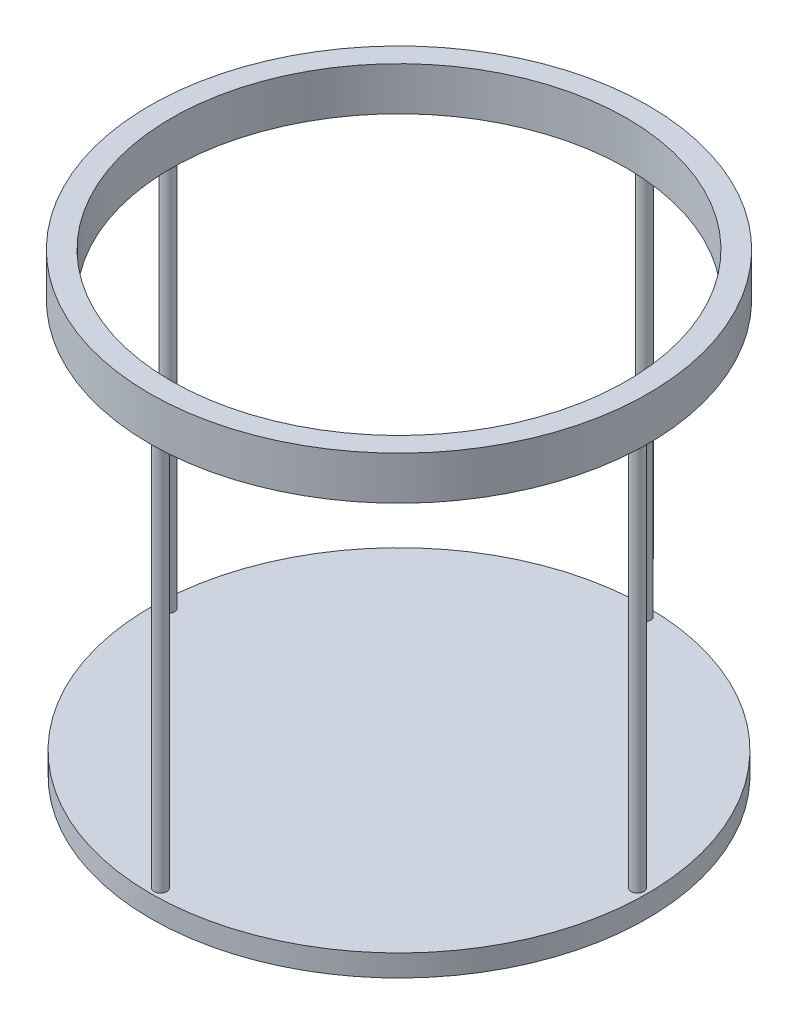
ISO-10303-21;
HEADER;
FILE_DESCRIPTION(('STEP AP214'),'2;1');
FILE_NAME('part.step','',(''),(''),'','','');
FILE_SCHEMA(('AUTOMOTIVE_DESIGN { 1 0 10303 214 1 1 1 1 }'));
ENDSEC;
DATA;
#1=APPLICATION_CONTEXT('core data for automotive mechanical design processes');
#2=APPLICATION_PROTOCOL_DEFINITION('international standard','automotive_design',2000,#1);
#3=PRODUCT_CONTEXT('',#1,'mechanical');
#4=PRODUCT('Part','Part','',(#3));
#5=PRODUCT_RELATED_PRODUCT_CATEGORY('part','',(#4));
#6=PRODUCT_DEFINITION_FORMATION('','',#4);
#7=PRODUCT_DEFINITION_CONTEXT('part definition',#1,'design');
#8=PRODUCT_DEFINITION('design','',#6,#7);
#9=PRODUCT_DEFINITION_SHAPE('','',#8);
#10=(LENGTH_UNIT() NAMED_UNIT(*) SI_UNIT(.MILLI.,.METRE.));
#11=(NAMED_UNIT(*) PLANE_ANGLE_UNIT() SI_UNIT($,.RADIAN.));
#12=(NAMED_UNIT(*) SI_UNIT($,.STERADIAN.) SOLID_ANGLE_UNIT());
#13=UNCERTAINTY_MEASURE_WITH_UNIT(LENGTH_MEASURE(1.E-05),#10,'distance_accuracy_value','');
#14=(GEOMETRIC_REPRESENTATION_CONTEXT(3) GLOBAL_UNCERTAINTY_ASSIGNED_CONTEXT((#13)) GLOBAL_UNIT_ASSIGNED_CONTEXT((#10,
#11,#12)) REPRESENTATION_CONTEXT('',''));
#15=CARTESIAN_POINT('',(0.,0.,0.));
#16=DIRECTION('',(0.,0.,1.));
#17=DIRECTION('',(1.,0.,0.));
#18=AXIS2_PLACEMENT_3D('',#15,#16,#17);
#19=CARTESIAN_POINT('',(0.,10.,0.));
#20=DIRECTION('',(0.,1.,0.));
#21=DIRECTION('',(0.,0.,1.));
#22=AXIS2_PLACEMENT_3D('',#19,#20,#21);
#23=PLANE('',#22);
#24=CARTESIAN_POINT('',(0.,10.,0.));
#25=DIRECTION('',(0.,1.,0.));
#26=DIRECTION('',(0.,0.,1.));
#27=AXIS2_PLACEMENT_3D('',#24,#25,#26);
#28=CIRCLE('',#27,57.5);
#29=CARTESIAN_POINT('',(0.,10.,57.5));
#30=VERTEX_POINT('',#29);
#31=EDGE_CURVE('E51',#30,#30,#28,.T.);
#32=ORIENTED_EDGE('',*,*,#31,.T.);
#33=EDGE_LOOP('',(#32));
#34=FACE_BOUND('',#33,.T.);
#35=CARTESIAN_POINT('',(0.,10.,0.));
#36=DIRECTION('',(0.,1.,0.));
#37=DIRECTION('',(0.,0.,1.));
#38=AXIS2_PLACEMENT_3D('',#35,#36,#37);
#39=CIRCLE('',#38,52.5);
#40=CARTESIAN_POINT('',(0.,10.,52.5));
#41=VERTEX_POINT('',#40);
#42=EDGE_CURVE('E55',#41,#41,#39,.T.);
#43=ORIENTED_EDGE('',*,*,#42,.F.);
#44=EDGE_LOOP('',(#43));
#45=FACE_BOUND('',#44,.T.);
#46=ADVANCED_FACE('F31',(#34,#45),#23,.T.);
#47=CARTESIAN_POINT('',(0.,0.,0.));
#48=DIRECTION('',(0.,1.,0.));
#49=DIRECTION('',(0.,0.,1.));
#50=AXIS2_PLACEMENT_3D('',#47,#48,#49);
#51=PLANE('',#50);
#52=CARTESIAN_POINT('',(-55.,0.,-1.76031313179692));
#53=DIRECTION('',(0.,1.,0.));
#54=DIRECTION('',(0.,0.,1.));
#55=AXIS2_PLACEMENT_3D('',#52,#53,#54);
#56=CIRCLE('',#55,1.45);
#57=CARTESIAN_POINT('',(-55.,0.,-0.310313131796919));
#58=VERTEX_POINT('',#57);
#59=EDGE_CURVE('E10',#58,#58,#56,.F.);
#60=ORIENTED_EDGE('',*,*,#59,.F.);
#61=EDGE_LOOP('',(#60));
#62=FACE_BOUND('',#61,.T.);
#63=CARTESIAN_POINT('',(55.,0.,0.));
#64=DIRECTION('',(0.,1.,0.));
#65=DIRECTION('',(0.,0.,1.));
#66=AXIS2_PLACEMENT_3D('',#63,#64,#65);
#67=CIRCLE('',#66,1.45);
#68=CARTESIAN_POINT('',(55.,0.,1.45));
#69=VERTEX_POINT('',#68);
#70=EDGE_CURVE('E38',#69,#69,#67,.F.);
#71=ORIENTED_EDGE('',*,*,#70,.F.);
#72=EDGE_LOOP('',(#71));
#73=FACE_BOUND('',#72,.T.);
#74=CARTESIAN_POINT('',(1.57822376486978,0.,-55.));
#75=DIRECTION('',(0.,1.,0.));
#76=DIRECTION('',(0.,0.,1.));
#77=AXIS2_PLACEMENT_3D('',#74,#75,#76);
#78=CIRCLE('',#77,1.45);
#79=CARTESIAN_POINT('',(1.57822376486978,0.,-53.55));
#80=VERTEX_POINT('',#79);
#81=EDGE_CURVE('E42',#80,#80,#78,.F.);
#82=ORIENTED_EDGE('',*,*,#81,.F.);
#83=EDGE_LOOP('',(#82));
#84=FACE_BOUND('',#83,.T.);
#85=CARTESIAN_POINT('',(0.,0.,55.));
#86=DIRECTION('',(0.,1.,0.));
#87=DIRECTION('',(0.,0.,1.));
#88=AXIS2_PLACEMENT_3D('',#85,#86,#87);
#89=CIRCLE('',#88,1.45);
#90=CARTESIAN_POINT('',(0.,0.,56.45));
#91=VERTEX_POINT('',#90);
#92=EDGE_CURVE('E46',#91,#91,#89,.F.);
#93=ORIENTED_EDGE('',*,*,#92,.F.);
#94=EDGE_LOOP('',(#93));
#95=FACE_BOUND('',#94,.T.);
#96=CARTESIAN_POINT('',(0.,0.,0.));
#97=DIRECTION('',(0.,1.,0.));
#98=DIRECTION('',(0.,0.,1.));
#99=AXIS2_PLACEMENT_3D('',#96,#97,#98);
#100=CIRCLE('',#99,57.5);
#101=CARTESIAN_POINT('',(0.,0.,57.5));
#102=VERTEX_POINT('',#101);
#103=EDGE_CURVE('E52',#102,#102,#100,.T.);
#104=ORIENTED_EDGE('',*,*,#103,.F.);
#105=EDGE_LOOP('',(#104));
#106=FACE_BOUND('',#105,.T.);
#107=CARTESIAN_POINT('',(0.,0.,0.));
#108=DIRECTION('',(0.,1.,0.));
#109=DIRECTION('',(0.,0.,1.));
#110=AXIS2_PLACEMENT_3D('',#107,#108,#109);
#111=CIRCLE('',#110,52.5);
#112=CARTESIAN_POINT('',(0.,0.,52.5));
#113=VERTEX_POINT('',#112);
#114=EDGE_CURVE('E58',#113,#113,#111,.T.);
#115=ORIENTED_EDGE('',*,*,#114,.T.);
#116=EDGE_LOOP('',(#115));
#117=FACE_BOUND('',#116,.T.);
#118=ADVANCED_FACE('F101',(#62,#73,#84,#95,#106,#117),#51,.F.);
#119=CARTESIAN_POINT('',(0.,10.,0.));
#120=DIRECTION('',(0.,-1.,0.));
#121=DIRECTION('',(0.,0.,-1.));
#122=AXIS2_PLACEMENT_3D('',#119,#120,#121);
#123=CYLINDRICAL_SURFACE('',#122,57.5);
#124=ORIENTED_EDGE('',*,*,#31,.F.);
#125=EDGE_LOOP('',(#124));
#126=FACE_BOUND('',#125,.T.);
#127=ORIENTED_EDGE('',*,*,#103,.T.);
#128=EDGE_LOOP('',(#127));
#129=FACE_BOUND('',#128,.T.);
#130=ADVANCED_FACE('F33',(#126,#129),#123,.T.);
#131=CARTESIAN_POINT('',(0.,10.,0.));
#132=DIRECTION('',(0.,-1.,0.));
#133=DIRECTION('',(0.,0.,-1.));
#134=AXIS2_PLACEMENT_3D('',#131,#132,#133);
#135=CYLINDRICAL_SURFACE('',#134,52.5);
#136=ORIENTED_EDGE('',*,*,#42,.T.);
#137=EDGE_LOOP('',(#136));
#138=FACE_BOUND('',#137,.T.);
#139=ORIENTED_EDGE('',*,*,#114,.F.);
#140=EDGE_LOOP('',(#139));
#141=FACE_BOUND('',#140,.T.);
#142=ADVANCED_FACE('F110',(#138,#141),#135,.F.);
#143=CARTESIAN_POINT('',(0.,-90.,55.));
#144=DIRECTION('',(0.,1.,0.));
#145=DIRECTION('',(0.,0.,1.));
#146=AXIS2_PLACEMENT_3D('',#143,#144,#145);
#147=CYLINDRICAL_SURFACE('',#146,1.45);
#148=CARTESIAN_POINT('',(0.,-90.,55.));
#149=DIRECTION('',(0.,-1.,0.));
#150=DIRECTION('',(0.,0.,-1.));
#151=AXIS2_PLACEMENT_3D('',#148,#149,#150);
#152=CIRCLE('',#151,1.45);
#153=CARTESIAN_POINT('',(0.,-90.,53.55));
#154=VERTEX_POINT('',#153);
#155=EDGE_CURVE('E61',#154,#154,#152,.T.);
#156=ORIENTED_EDGE('',*,*,#155,.F.);
#157=EDGE_LOOP('',(#156));
#158=FACE_BOUND('',#157,.T.);
#159=ORIENTED_EDGE('',*,*,#92,.T.);
#160=EDGE_LOOP('',(#159));
#161=FACE_BOUND('',#160,.T.);
#162=ADVANCED_FACE('F113',(#158,#161),#147,.T.);
#163=CARTESIAN_POINT('',(1.57822376486978,-90.,-55.));
#164=DIRECTION('',(0.,1.,0.));
#165=DIRECTION('',(0.,0.,1.));
#166=AXIS2_PLACEMENT_3D('',#163,#164,#165);
#167=CYLINDRICAL_SURFACE('',#166,1.45);
#168=CARTESIAN_POINT('',(1.57822376486978,-90.,-55.));
#169=DIRECTION('',(0.,-1.,0.));
#170=DIRECTION('',(0.,0.,-1.));
#171=AXIS2_PLACEMENT_3D('',#168,#169,#170);
#172=CIRCLE('',#171,1.45);
#173=CARTESIAN_POINT('',(1.57822376486978,-90.,-56.45));
#174=VERTEX_POINT('',#173);
#175=EDGE_CURVE('E66',#174,#174,#172,.T.);
#176=ORIENTED_EDGE('',*,*,#175,.F.);
#177=EDGE_LOOP('',(#176));
#178=FACE_BOUND('',#177,.T.);
#179=ORIENTED_EDGE('',*,*,#81,.T.);
#180=EDGE_LOOP('',(#179));
#181=FACE_BOUND('',#180,.T.);
#182=ADVANCED_FACE('F117',(#178,#181),#167,.T.);
#183=CARTESIAN_POINT('',(55.,-90.,0.));
#184=DIRECTION('',(0.,1.,0.));
#185=DIRECTION('',(0.,0.,1.));
#186=AXIS2_PLACEMENT_3D('',#183,#184,#185);
#187=CYLINDRICAL_SURFACE('',#186,1.45);
#188=CARTESIAN_POINT('',(55.,-90.,0.));
#189=DIRECTION('',(0.,-1.,0.));
#190=DIRECTION('',(0.,0.,-1.));
#191=AXIS2_PLACEMENT_3D('',#188,#189,#190);
#192=CIRCLE('',#191,1.45);
#193=CARTESIAN_POINT('',(55.,-90.,-1.45));
#194=VERTEX_POINT('',#193);
#195=EDGE_CURVE('E69',#194,#194,#192,.T.);
#196=ORIENTED_EDGE('',*,*,#195,.F.);
#197=EDGE_LOOP('',(#196));
#198=FACE_BOUND('',#197,.T.);
#199=ORIENTED_EDGE('',*,*,#70,.T.);
#200=EDGE_LOOP('',(#199));
#201=FACE_BOUND('',#200,.T.);
#202=ADVANCED_FACE('F121',(#198,#201),#187,.T.);
#203=CARTESIAN_POINT('',(-55.,-90.,-1.76031313179692));
#204=DIRECTION('',(0.,1.,0.));
#205=DIRECTION('',(0.,0.,1.));
#206=AXIS2_PLACEMENT_3D('',#203,#204,#205);
#207=CYLINDRICAL_SURFACE('',#206,1.45);
#208=CARTESIAN_POINT('',(-55.,-90.,-1.76031313179692));
#209=DIRECTION('',(0.,-1.,0.));
#210=DIRECTION('',(0.,0.,-1.));
#211=AXIS2_PLACEMENT_3D('',#208,#209,#210);
#212=CIRCLE('',#211,1.45);
#213=CARTESIAN_POINT('',(-55.,-90.,-3.21031313179692));
#214=VERTEX_POINT('',#213);
#215=EDGE_CURVE('E72',#214,#214,#212,.T.);
#216=ORIENTED_EDGE('',*,*,#215,.F.);
#217=EDGE_LOOP('',(#216));
#218=FACE_BOUND('',#217,.T.);
#219=ORIENTED_EDGE('',*,*,#59,.T.);
#220=EDGE_LOOP('',(#219));
#221=FACE_BOUND('',#220,.T.);
#222=ADVANCED_FACE('F87',(#218,#221),#207,.T.);
#223=CARTESIAN_POINT('',(0.,-95.,0.));
#224=DIRECTION('',(0.,1.,0.));
#225=DIRECTION('',(0.,0.,1.));
#226=AXIS2_PLACEMENT_3D('',#223,#224,#225);
#227=CYLINDRICAL_SURFACE('',#226,57.2276641342973);
#228=CARTESIAN_POINT('',(0.,-95.,0.));
#229=DIRECTION('',(0.,-1.,0.));
#230=DIRECTION('',(0.,0.,-1.));
#231=AXIS2_PLACEMENT_3D('',#228,#229,#230);
#232=CIRCLE('',#231,57.2276641342973);
#233=CARTESIAN_POINT('',(0.,-95.,-57.2276641342973));
#234=VERTEX_POINT('',#233);
#235=EDGE_CURVE('E75',#234,#234,#232,.T.);
#236=ORIENTED_EDGE('',*,*,#235,.F.);
#237=EDGE_LOOP('',(#236));
#238=FACE_BOUND('',#237,.T.);
#239=CARTESIAN_POINT('',(0.,-90.,0.));
#240=DIRECTION('',(0.,-1.,0.));
#241=DIRECTION('',(0.,0.,-1.));
#242=AXIS2_PLACEMENT_3D('',#239,#240,#241);
#243=CIRCLE('',#242,57.2276641342973);
#244=CARTESIAN_POINT('',(0.,-90.,-57.2276641342973));
#245=VERTEX_POINT('',#244);
#246=EDGE_CURVE('E76',#245,#245,#243,.T.);
#247=ORIENTED_EDGE('',*,*,#246,.T.);
#248=EDGE_LOOP('',(#247));
#249=FACE_BOUND('',#248,.T.);
#250=ADVANCED_FACE('F84',(#238,#249),#227,.T.);
#251=CARTESIAN_POINT('',(0.,-95.,0.));
#252=DIRECTION('',(0.,-1.,0.));
#253=DIRECTION('',(0.,0.,-1.));
#254=AXIS2_PLACEMENT_3D('',#251,#252,#253);
#255=PLANE('',#254);
#256=ORIENTED_EDGE('',*,*,#235,.T.);
#257=EDGE_LOOP('',(#256));
#258=FACE_BOUND('',#257,.T.);
#259=ADVANCED_FACE('F82',(#258),#255,.T.);
#260=CARTESIAN_POINT('',(0.,-90.,0.));
#261=DIRECTION('',(0.,-1.,0.));
#262=DIRECTION('',(0.,0.,-1.));
#263=AXIS2_PLACEMENT_3D('',#260,#261,#262);
#264=PLANE('',#263);
#265=ORIENTED_EDGE('',*,*,#155,.T.);
#266=EDGE_LOOP('',(#265));
#267=FACE_BOUND('',#266,.T.);
#268=ORIENTED_EDGE('',*,*,#175,.T.);
#269=EDGE_LOOP('',(#268));
#270=FACE_BOUND('',#269,.T.);
#271=ORIENTED_EDGE('',*,*,#195,.T.);
#272=EDGE_LOOP('',(#271));
#273=FACE_BOUND('',#272,.T.);
#274=ORIENTED_EDGE('',*,*,#215,.T.);
#275=EDGE_LOOP('',(#274));
#276=FACE_BOUND('',#275,.T.);
#277=ORIENTED_EDGE('',*,*,#246,.F.);
#278=EDGE_LOOP('',(#277));
#279=FACE_BOUND('',#278,.T.);
#280=ADVANCED_FACE('F91',(#267,#270,#273,#276,#279),#264,.F.);
#281=CLOSED_SHELL('',(#46,#118,#130,#142,#162,#182,#202,#222,#250,#259,#280));
#282=MANIFOLD_SOLID_BREP('B2',#281);
#283=ADVANCED_BREP_SHAPE_REPRESENTATION('',(#18,#282),#14);
#284=SHAPE_DEFINITION_REPRESENTATION(#9,#283);
ENDSEC;
END-ISO-10303-21;
